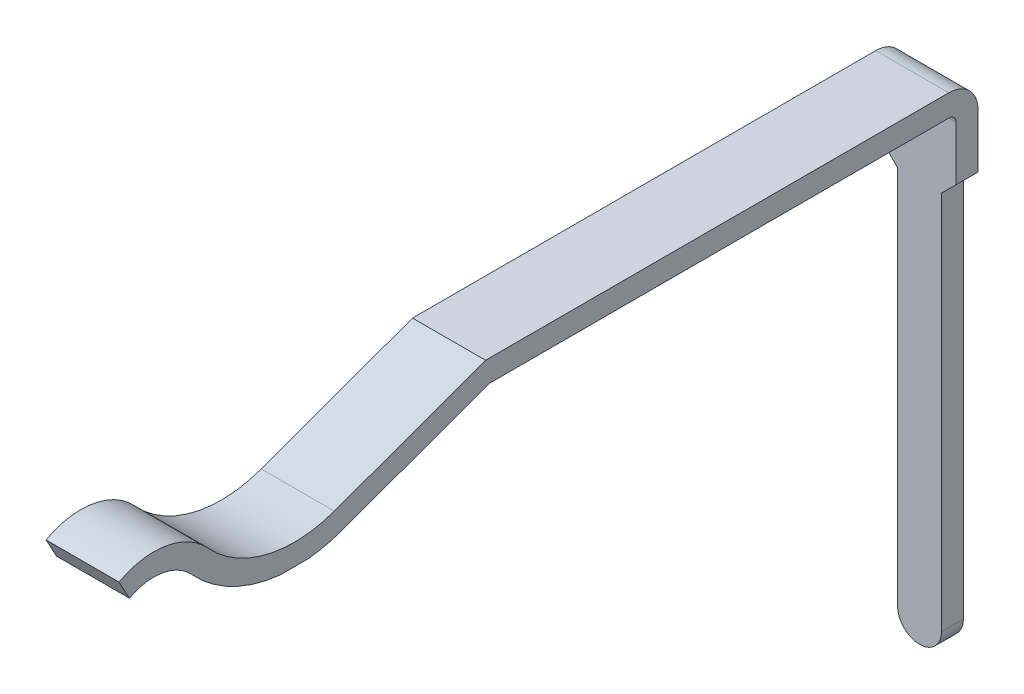
ISO-10303-21;
HEADER;
FILE_DESCRIPTION(('STEP AP214'),'2;1');
FILE_NAME('part.step','',(''),(''),'','','');
FILE_SCHEMA(('AUTOMOTIVE_DESIGN { 1 0 10303 214 1 1 1 1 }'));
ENDSEC;
DATA;
#1=APPLICATION_CONTEXT('core data for automotive mechanical design processes');
#2=APPLICATION_PROTOCOL_DEFINITION('international standard','automotive_design',2000,#1);
#3=PRODUCT_CONTEXT('',#1,'mechanical');
#4=PRODUCT('Part','Part','',(#3));
#5=PRODUCT_RELATED_PRODUCT_CATEGORY('part','',(#4));
#6=PRODUCT_DEFINITION_FORMATION('','',#4);
#7=PRODUCT_DEFINITION_CONTEXT('part definition',#1,'design');
#8=PRODUCT_DEFINITION('design','',#6,#7);
#9=PRODUCT_DEFINITION_SHAPE('','',#8);
#10=(LENGTH_UNIT() NAMED_UNIT(*) SI_UNIT(.MILLI.,.METRE.));
#11=(NAMED_UNIT(*) PLANE_ANGLE_UNIT() SI_UNIT($,.RADIAN.));
#12=(NAMED_UNIT(*) SI_UNIT($,.STERADIAN.) SOLID_ANGLE_UNIT());
#13=UNCERTAINTY_MEASURE_WITH_UNIT(LENGTH_MEASURE(1.E-05),#10,'distance_accuracy_value','');
#14=(GEOMETRIC_REPRESENTATION_CONTEXT(3) GLOBAL_UNCERTAINTY_ASSIGNED_CONTEXT((#13)) GLOBAL_UNIT_ASSIGNED_CONTEXT((#10,
#11,#12)) REPRESENTATION_CONTEXT('',''));
#15=CARTESIAN_POINT('',(0.,0.,0.));
#16=DIRECTION('',(0.,0.,1.));
#17=DIRECTION('',(1.,0.,0.));
#18=AXIS2_PLACEMENT_3D('',#15,#16,#17);
#19=CARTESIAN_POINT('',(0.5,-0.4,-12.46));
#20=DIRECTION('',(0.,0.,-1.));
#21=DIRECTION('',(0.,1.,0.));
#22=AXIS2_PLACEMENT_3D('',#19,#20,#21);
#23=PLANE('',#22);
#24=DIRECTION('',(0.,1.,0.));
#25=VECTOR('',#24,1.);
#26=CARTESIAN_POINT('',(0.3,-0.4,-12.46));
#27=LINE('',#26,#25);
#28=CARTESIAN_POINT('',(0.3,-6.54,-12.46));
#29=VERTEX_POINT('',#28);
#30=CARTESIAN_POINT('',(0.3,-1.34,-12.46));
#31=VERTEX_POINT('',#30);
#32=EDGE_CURVE('E221',#29,#31,#27,.T.);
#33=ORIENTED_EDGE('',*,*,#32,.T.);
#34=DIRECTION('',(0.707106781186551,0.707106781186544,0.));
#35=VECTOR('',#34,1.);
#36=CARTESIAN_POINT('',(0.870000000000001,-0.770000000000005,-12.46));
#37=LINE('',#36,#35);
#38=CARTESIAN_POINT('',(0.499999999999999,-1.14,-12.46));
#39=VERTEX_POINT('',#38);
#40=EDGE_CURVE('E216',#31,#39,#37,.T.);
#41=ORIENTED_EDGE('',*,*,#40,.T.);
#42=DIRECTION('',(0.,-1.,0.));
#43=VECTOR('',#42,1.);
#44=CARTESIAN_POINT('',(0.5,-0.4,-12.46));
#45=LINE('',#44,#43);
#46=CARTESIAN_POINT('',(0.5,-0.4,-12.46));
#47=VERTEX_POINT('',#46);
#48=EDGE_CURVE('E226',#47,#39,#45,.T.);
#49=ORIENTED_EDGE('',*,*,#48,.F.);
#50=DIRECTION('',(-1.,0.,0.));
#51=VECTOR('',#50,1.);
#52=CARTESIAN_POINT('',(0.5,-0.4,-12.46));
#53=LINE('',#52,#51);
#54=CARTESIAN_POINT('',(-0.5,-0.4,-12.46));
#55=VERTEX_POINT('',#54);
#56=EDGE_CURVE('E263',#47,#55,#53,.T.);
#57=ORIENTED_EDGE('',*,*,#56,.T.);
#58=DIRECTION('',(0.,-1.,0.));
#59=VECTOR('',#58,1.);
#60=CARTESIAN_POINT('',(-0.5,-0.4,-12.46));
#61=LINE('',#60,#59);
#62=CARTESIAN_POINT('',(-0.5,-1.14,-12.46));
#63=VERTEX_POINT('',#62);
#64=EDGE_CURVE('E225',#55,#63,#61,.T.);
#65=ORIENTED_EDGE('',*,*,#64,.T.);
#66=DIRECTION('',(0.707106781186544,-0.707106781186551,0.));
#67=VECTOR('',#66,1.);
#68=CARTESIAN_POINT('',(-0.370000000000004,-1.26999999999999,-12.46));
#69=LINE('',#68,#67);
#70=CARTESIAN_POINT('',(-0.3,-1.34,-12.46));
#71=VERTEX_POINT('',#70);
#72=EDGE_CURVE('E212',#63,#71,#69,.T.);
#73=ORIENTED_EDGE('',*,*,#72,.T.);
#74=DIRECTION('',(0.,-1.,0.));
#75=VECTOR('',#74,1.);
#76=CARTESIAN_POINT('',(-0.3,-0.4,-12.46));
#77=LINE('',#76,#75);
#78=CARTESIAN_POINT('',(-0.3,-6.54,-12.46));
#79=VERTEX_POINT('',#78);
#80=EDGE_CURVE('E219',#71,#79,#77,.T.);
#81=ORIENTED_EDGE('',*,*,#80,.T.);
#82=CARTESIAN_POINT('',(0.,-6.54,-12.46));
#83=DIRECTION('',(0.,0.,-1.));
#84=DIRECTION('',(0.,1.,0.));
#85=AXIS2_PLACEMENT_3D('',#82,#83,#84);
#86=CIRCLE('',#85,0.3);
#87=EDGE_CURVE('E175',#79,#29,#86,.F.);
#88=ORIENTED_EDGE('',*,*,#87,.T.);
#89=EDGE_LOOP('',(#33,#41,#49,#57,#65,#73,#81,#88));
#90=FACE_BOUND('',#89,.T.);
#91=ADVANCED_FACE('F34',(#90),#23,.F.);
#92=CARTESIAN_POINT('',(0.5,-0.4,-12.76));
#93=DIRECTION('',(0.,0.,-1.));
#94=DIRECTION('',(0.,1.,0.));
#95=AXIS2_PLACEMENT_3D('',#92,#93,#94);
#96=PLANE('',#95);
#97=DIRECTION('',(-0.707106781186551,-0.707106781186544,0.));
#98=VECTOR('',#97,1.);
#99=CARTESIAN_POINT('',(0.499999999999999,-1.14,-12.76));
#100=LINE('',#99,#98);
#101=CARTESIAN_POINT('',(0.499999999999999,-1.14,-12.76));
#102=VERTEX_POINT('',#101);
#103=CARTESIAN_POINT('',(0.3,-1.34,-12.76));
#104=VERTEX_POINT('',#103);
#105=EDGE_CURVE('E197',#102,#104,#100,.T.);
#106=ORIENTED_EDGE('',*,*,#105,.T.);
#107=DIRECTION('',(0.,-1.,0.));
#108=VECTOR('',#107,1.);
#109=CARTESIAN_POINT('',(0.3,-1.34,-12.76));
#110=LINE('',#109,#108);
#111=CARTESIAN_POINT('',(0.3,-6.54,-12.76));
#112=VERTEX_POINT('',#111);
#113=EDGE_CURVE('E179',#104,#112,#110,.T.);
#114=ORIENTED_EDGE('',*,*,#113,.T.);
#115=CARTESIAN_POINT('',(0.,-6.54,-12.76));
#116=DIRECTION('',(0.,0.,-1.));
#117=DIRECTION('',(1.,0.,0.));
#118=AXIS2_PLACEMENT_3D('',#115,#116,#117);
#119=CIRCLE('',#118,0.3);
#120=CARTESIAN_POINT('',(-0.3,-6.54,-12.76));
#121=VERTEX_POINT('',#120);
#122=EDGE_CURVE('E173',#112,#121,#119,.T.);
#123=ORIENTED_EDGE('',*,*,#122,.T.);
#124=DIRECTION('',(0.,1.,0.));
#125=VECTOR('',#124,1.);
#126=CARTESIAN_POINT('',(-0.3,-6.54,-12.76));
#127=LINE('',#126,#125);
#128=CARTESIAN_POINT('',(-0.3,-1.34,-12.76));
#129=VERTEX_POINT('',#128);
#130=EDGE_CURVE('E182',#121,#129,#127,.T.);
#131=ORIENTED_EDGE('',*,*,#130,.T.);
#132=DIRECTION('',(-0.707106781186544,0.707106781186551,0.));
#133=VECTOR('',#132,1.);
#134=CARTESIAN_POINT('',(-0.3,-1.34,-12.76));
#135=LINE('',#134,#133);
#136=CARTESIAN_POINT('',(-0.5,-1.14,-12.76));
#137=VERTEX_POINT('',#136);
#138=EDGE_CURVE('E188',#129,#137,#135,.T.);
#139=ORIENTED_EDGE('',*,*,#138,.T.);
#140=DIRECTION('',(0.,-1.,0.));
#141=VECTOR('',#140,1.);
#142=CARTESIAN_POINT('',(-0.5,-0.4,-12.76));
#143=LINE('',#142,#141);
#144=CARTESIAN_POINT('',(-0.5,-0.4,-12.76));
#145=VERTEX_POINT('',#144);
#146=EDGE_CURVE('E266',#145,#137,#143,.T.);
#147=ORIENTED_EDGE('',*,*,#146,.F.);
#148=DIRECTION('',(-1.,0.,0.));
#149=VECTOR('',#148,1.);
#150=CARTESIAN_POINT('',(0.5,-0.4,-12.76));
#151=LINE('',#150,#149);
#152=CARTESIAN_POINT('',(0.5,-0.4,-12.76));
#153=VERTEX_POINT('',#152);
#154=EDGE_CURVE('E324',#153,#145,#151,.T.);
#155=ORIENTED_EDGE('',*,*,#154,.F.);
#156=DIRECTION('',(0.,-1.,0.));
#157=VECTOR('',#156,1.);
#158=CARTESIAN_POINT('',(0.5,-0.4,-12.76));
#159=LINE('',#158,#157);
#160=EDGE_CURVE('E229',#153,#102,#159,.T.);
#161=ORIENTED_EDGE('',*,*,#160,.T.);
#162=EDGE_LOOP('',(#106,#114,#123,#131,#139,#147,#155,#161));
#163=FACE_BOUND('',#162,.T.);
#164=ADVANCED_FACE('F192',(#163),#96,.T.);
#165=CARTESIAN_POINT('',(0.5,-0.4,-12.36));
#166=DIRECTION('',(-1.,0.,0.));
#167=DIRECTION('',(0.,0.,1.));
#168=AXIS2_PLACEMENT_3D('',#165,#166,#167);
#169=CYLINDRICAL_SURFACE('',#168,0.4);
#170=CARTESIAN_POINT('',(-0.5,-0.4,-12.36));
#171=DIRECTION('',(-1.,0.,0.));
#172=DIRECTION('',(0.,0.,1.));
#173=AXIS2_PLACEMENT_3D('',#170,#171,#172);
#174=CIRCLE('',#173,0.4);
#175=CARTESIAN_POINT('',(-0.5,0.,-12.36));
#176=VERTEX_POINT('',#175);
#177=EDGE_CURVE('E269',#176,#145,#174,.T.);
#178=ORIENTED_EDGE('',*,*,#177,.F.);
#179=DIRECTION('',(-1.,0.,0.));
#180=VECTOR('',#179,1.);
#181=CARTESIAN_POINT('',(0.5,0.,-12.36));
#182=LINE('',#181,#180);
#183=CARTESIAN_POINT('',(0.5,0.,-12.36));
#184=VERTEX_POINT('',#183);
#185=EDGE_CURVE('E322',#184,#176,#182,.T.);
#186=ORIENTED_EDGE('',*,*,#185,.F.);
#187=CARTESIAN_POINT('',(0.5,-0.4,-12.36));
#188=DIRECTION('',(-1.,0.,0.));
#189=DIRECTION('',(0.,0.,1.));
#190=AXIS2_PLACEMENT_3D('',#187,#188,#189);
#191=CIRCLE('',#190,0.4);
#192=EDGE_CURVE('E233',#184,#153,#191,.T.);
#193=ORIENTED_EDGE('',*,*,#192,.T.);
#194=ORIENTED_EDGE('',*,*,#154,.T.);
#195=EDGE_LOOP('',(#178,#186,#193,#194));
#196=FACE_BOUND('',#195,.T.);
#197=ADVANCED_FACE('F378',(#196),#169,.T.);
#198=CARTESIAN_POINT('',(0.5,0.,-6.01747897566997));
#199=DIRECTION('',(0.,1.,0.));
#200=DIRECTION('',(0.,0.,1.));
#201=AXIS2_PLACEMENT_3D('',#198,#199,#200);
#202=PLANE('',#201);
#203=DIRECTION('',(0.,0.,-1.));
#204=VECTOR('',#203,1.);
#205=CARTESIAN_POINT('',(-0.5,0.,-6.01747897566997));
#206=LINE('',#205,#204);
#207=CARTESIAN_POINT('',(-0.5,0.,-6.01747897566997));
#208=VERTEX_POINT('',#207);
#209=EDGE_CURVE('E272',#208,#176,#206,.T.);
#210=ORIENTED_EDGE('',*,*,#209,.F.);
#211=DIRECTION('',(-1.,0.,0.));
#212=VECTOR('',#211,1.);
#213=CARTESIAN_POINT('',(0.5,0.,-6.01747897566997));
#214=LINE('',#213,#212);
#215=CARTESIAN_POINT('',(0.5,0.,-6.01747897566997));
#216=VERTEX_POINT('',#215);
#217=EDGE_CURVE('E320',#216,#208,#214,.T.);
#218=ORIENTED_EDGE('',*,*,#217,.F.);
#219=DIRECTION('',(0.,0.,-1.));
#220=VECTOR('',#219,1.);
#221=CARTESIAN_POINT('',(0.5,0.,-6.01747897566997));
#222=LINE('',#221,#220);
#223=EDGE_CURVE('E236',#216,#184,#222,.T.);
#224=ORIENTED_EDGE('',*,*,#223,.T.);
#225=ORIENTED_EDGE('',*,*,#185,.T.);
#226=EDGE_LOOP('',(#210,#218,#224,#225));
#227=FACE_BOUND('',#226,.T.);
#228=ADVANCED_FACE('F374',(#227),#202,.T.);
#229=CARTESIAN_POINT('',(0.5,0.,-6.01747897566997));
#230=DIRECTION('',(0.,0.939692620785908,0.342020143325669));
#231=DIRECTION('',(0.,-0.342020143325669,0.939692620785908));
#232=AXIS2_PLACEMENT_3D('',#229,#230,#231);
#233=PLANE('',#232);
#234=DIRECTION('',(0.,0.342020143325669,-0.939692620785908));
#235=VECTOR('',#234,1.);
#236=CARTESIAN_POINT('',(-0.5,0.,-6.01747897566997));
#237=LINE('',#236,#235);
#238=CARTESIAN_POINT('',(-0.5,-0.753508193257452,-3.94723222932107));
#239=VERTEX_POINT('',#238);
#240=EDGE_CURVE('E275',#239,#208,#237,.T.);
#241=ORIENTED_EDGE('',*,*,#240,.F.);
#242=DIRECTION('',(-1.,0.,0.));
#243=VECTOR('',#242,1.);
#244=CARTESIAN_POINT('',(0.5,-0.753508193257452,-3.94723222932107));
#245=LINE('',#244,#243);
#246=CARTESIAN_POINT('',(0.5,-0.753508193257452,-3.94723222932107));
#247=VERTEX_POINT('',#246);
#248=EDGE_CURVE('E318',#247,#239,#245,.T.);
#249=ORIENTED_EDGE('',*,*,#248,.F.);
#250=DIRECTION('',(0.,0.342020143325669,-0.939692620785908));
#251=VECTOR('',#250,1.);
#252=CARTESIAN_POINT('',(0.5,0.,-6.01747897566997));
#253=LINE('',#252,#251);
#254=EDGE_CURVE('E239',#247,#216,#253,.T.);
#255=ORIENTED_EDGE('',*,*,#254,.T.);
#256=ORIENTED_EDGE('',*,*,#217,.T.);
#257=EDGE_LOOP('',(#241,#249,#255,#256));
#258=FACE_BOUND('',#257,.T.);
#259=ADVANCED_FACE('F370',(#258),#233,.T.);
#260=CARTESIAN_POINT('',(0.5,0.750000000000001,-3.4));
#261=DIRECTION('',(-1.,0.,0.));
#262=DIRECTION('',(0.,0.,1.));
#263=AXIS2_PLACEMENT_3D('',#260,#261,#262);
#264=CYLINDRICAL_SURFACE('',#263,1.6);
#265=CARTESIAN_POINT('',(-0.5,0.750000000000001,-3.4));
#266=DIRECTION('',(1.,0.,0.));
#267=DIRECTION('',(0.,0.,1.));
#268=AXIS2_PLACEMENT_3D('',#265,#266,#267);
#269=CIRCLE('',#268,1.6);
#270=CARTESIAN_POINT('',(-0.5,-0.326923076923077,-2.21668402935204));
#271=VERTEX_POINT('',#270);
#272=EDGE_CURVE('E278',#271,#239,#269,.T.);
#273=ORIENTED_EDGE('',*,*,#272,.F.);
#274=DIRECTION('',(-1.,0.,0.));
#275=VECTOR('',#274,1.);
#276=CARTESIAN_POINT('',(0.5,-0.326923076923077,-2.21668402935204));
#277=LINE('',#276,#275);
#278=CARTESIAN_POINT('',(0.5,-0.326923076923077,-2.21668402935204));
#279=VERTEX_POINT('',#278);
#280=EDGE_CURVE('E316',#279,#271,#277,.T.);
#281=ORIENTED_EDGE('',*,*,#280,.F.);
#282=CARTESIAN_POINT('',(0.5,0.750000000000001,-3.4));
#283=DIRECTION('',(1.,0.,0.));
#284=DIRECTION('',(0.,0.,1.));
#285=AXIS2_PLACEMENT_3D('',#282,#283,#284);
#286=CIRCLE('',#285,1.6);
#287=EDGE_CURVE('E242',#279,#247,#286,.T.);
#288=ORIENTED_EDGE('',*,*,#287,.T.);
#289=ORIENTED_EDGE('',*,*,#248,.T.);
#290=EDGE_LOOP('',(#273,#281,#288,#289));
#291=FACE_BOUND('',#290,.T.);
#292=ADVANCED_FACE('F366',(#291),#264,.F.);
#293=CARTESIAN_POINT('',(0.5,-1.,-1.47711154769706));
#294=DIRECTION('',(-1.,0.,0.));
#295=DIRECTION('',(0.,0.,1.));
#296=AXIS2_PLACEMENT_3D('',#293,#294,#295);
#297=CYLINDRICAL_SURFACE('',#296,1.);
#298=CARTESIAN_POINT('',(-0.5,-1.,-1.47711154769706));
#299=DIRECTION('',(-1.,0.,0.));
#300=DIRECTION('',(0.,0.,-1.));
#301=AXIS2_PLACEMENT_3D('',#298,#299,#300);
#302=CIRCLE('',#301,1.);
#303=CARTESIAN_POINT('',(-0.5,-0.121157254650118,-1.));
#304=VERTEX_POINT('',#303);
#305=EDGE_CURVE('E281',#304,#271,#302,.T.);
#306=ORIENTED_EDGE('',*,*,#305,.F.);
#307=DIRECTION('',(-1.,0.,0.));
#308=VECTOR('',#307,1.);
#309=CARTESIAN_POINT('',(0.5,-0.121157254650118,-1.));
#310=LINE('',#309,#308);
#311=CARTESIAN_POINT('',(0.5,-0.121157254650118,-1.));
#312=VERTEX_POINT('',#311);
#313=EDGE_CURVE('E314',#312,#304,#310,.T.);
#314=ORIENTED_EDGE('',*,*,#313,.F.);
#315=CARTESIAN_POINT('',(0.5,-1.,-1.47711154769706));
#316=DIRECTION('',(-1.,0.,0.));
#317=DIRECTION('',(0.,0.,-1.));
#318=AXIS2_PLACEMENT_3D('',#315,#316,#317);
#319=CIRCLE('',#318,1.);
#320=EDGE_CURVE('E245',#312,#279,#319,.T.);
#321=ORIENTED_EDGE('',*,*,#320,.T.);
#322=ORIENTED_EDGE('',*,*,#280,.T.);
#323=EDGE_LOOP('',(#306,#314,#321,#322));
#324=FACE_BOUND('',#323,.T.);
#325=ADVANCED_FACE('F362',(#324),#297,.T.);
#326=CARTESIAN_POINT('',(0.5,-0.384810078255083,-1.14313346430912));
#327=DIRECTION('',(0.,-0.477111547697059,0.878842745349882));
#328=DIRECTION('',(0.,-0.878842745349882,-0.477111547697059));
#329=AXIS2_PLACEMENT_3D('',#326,#327,#328);
#330=PLANE('',#329);
#331=DIRECTION('',(0.,0.878842745349882,0.477111547697059));
#332=VECTOR('',#331,1.);
#333=CARTESIAN_POINT('',(-0.5,-0.384810078255083,-1.14313346430912));
#334=LINE('',#333,#332);
#335=CARTESIAN_POINT('',(-0.5,-0.384810078255083,-1.14313346430912));
#336=VERTEX_POINT('',#335);
#337=EDGE_CURVE('E284',#336,#304,#334,.T.);
#338=ORIENTED_EDGE('',*,*,#337,.F.);
#339=DIRECTION('',(-1.,0.,0.));
#340=VECTOR('',#339,1.);
#341=CARTESIAN_POINT('',(0.5,-0.384810078255083,-1.14313346430912));
#342=LINE('',#341,#340);
#343=CARTESIAN_POINT('',(0.5,-0.384810078255083,-1.14313346430912));
#344=VERTEX_POINT('',#343);
#345=EDGE_CURVE('E312',#344,#336,#342,.T.);
#346=ORIENTED_EDGE('',*,*,#345,.F.);
#347=DIRECTION('',(0.,0.878842745349882,0.477111547697059));
#348=VECTOR('',#347,1.);
#349=CARTESIAN_POINT('',(0.5,-0.384810078255083,-1.14313346430912));
#350=LINE('',#349,#348);
#351=EDGE_CURVE('E248',#344,#312,#350,.T.);
#352=ORIENTED_EDGE('',*,*,#351,.T.);
#353=ORIENTED_EDGE('',*,*,#313,.T.);
#354=EDGE_LOOP('',(#338,#346,#352,#353));
#355=FACE_BOUND('',#354,.T.);
#356=ADVANCED_FACE('F359',(#355),#330,.T.);
#357=CARTESIAN_POINT('',(0.5,-1.,-1.47711154769706));
#358=DIRECTION('',(-1.,0.,0.));
#359=DIRECTION('',(0.,0.,1.));
#360=AXIS2_PLACEMENT_3D('',#357,#358,#359);
#361=CYLINDRICAL_SURFACE('',#360,0.7);
#362=CARTESIAN_POINT('',(-0.5,-1.,-1.47711154769706));
#363=DIRECTION('',(1.,0.,0.));
#364=DIRECTION('',(0.,0.,-1.));
#365=AXIS2_PLACEMENT_3D('',#362,#363,#364);
#366=CIRCLE('',#365,0.7);
#367=CARTESIAN_POINT('',(-0.5,-0.528846153846154,-1.99481228485554));
#368=VERTEX_POINT('',#367);
#369=EDGE_CURVE('E287',#336,#368,#366,.F.);
#370=ORIENTED_EDGE('',*,*,#369,.T.);
#371=DIRECTION('',(-1.,0.,0.));
#372=VECTOR('',#371,1.);
#373=CARTESIAN_POINT('',(0.5,-0.528846153846154,-1.99481228485554));
#374=LINE('',#373,#372);
#375=CARTESIAN_POINT('',(0.5,-0.528846153846154,-1.99481228485554));
#376=VERTEX_POINT('',#375);
#377=EDGE_CURVE('E309',#376,#368,#374,.T.);
#378=ORIENTED_EDGE('',*,*,#377,.F.);
#379=CARTESIAN_POINT('',(0.5,-1.,-1.47711154769706));
#380=DIRECTION('',(1.,0.,0.));
#381=DIRECTION('',(0.,0.,-1.));
#382=AXIS2_PLACEMENT_3D('',#379,#380,#381);
#383=CIRCLE('',#382,0.7);
#384=EDGE_CURVE('E251',#344,#376,#383,.F.);
#385=ORIENTED_EDGE('',*,*,#384,.F.);
#386=ORIENTED_EDGE('',*,*,#345,.T.);
#387=EDGE_LOOP('',(#370,#378,#385,#386));
#388=FACE_BOUND('',#387,.T.);
#389=ADVANCED_FACE('F355',(#388),#361,.F.);
#390=CARTESIAN_POINT('',(0.5,0.750000000000001,-3.4));
#391=DIRECTION('',(-1.,0.,0.));
#392=DIRECTION('',(0.,0.,1.));
#393=AXIS2_PLACEMENT_3D('',#390,#391,#392);
#394=CYLINDRICAL_SURFACE('',#393,1.9);
#395=CARTESIAN_POINT('',(0.5,0.750000000000001,-3.4));
#396=DIRECTION('',(1.,0.,0.));
#397=DIRECTION('',(0.,0.,-1.));
#398=AXIS2_PLACEMENT_3D('',#395,#396,#397);
#399=CIRCLE('',#398,1.9);
#400=CARTESIAN_POINT('',(0.5,-1.14,-3.5946792233393));
#401=VERTEX_POINT('',#400);
#402=CARTESIAN_POINT('',(0.5,-1.03541597949322,-4.04983827231877));
#403=VERTEX_POINT('',#402);
#404=EDGE_CURVE('E253',#401,#403,#399,.T.);
#405=ORIENTED_EDGE('',*,*,#404,.F.);
#406=CARTESIAN_POINT('',(2.39000000000002,0.750000000000001,-3.4));
#407=DIRECTION('',(-0.707106781186544,0.707106781186551,0.));
#408=DIRECTION('',(-0.707106781186551,-0.707106781186544,0.));
#409=AXIS2_PLACEMENT_3D('',#406,#407,#408);
#410=ELLIPSE('',#409,2.6870057685089,1.9);
#411=CARTESIAN_POINT('',(0.499999999999999,-1.14,-3.2053207766607));
#412=VERTEX_POINT('',#411);
#413=EDGE_CURVE('E47',#401,#412,#410,.T.);
#414=ORIENTED_EDGE('',*,*,#413,.T.);
#415=EDGE_CURVE('E254',#376,#412,#399,.T.);
#416=ORIENTED_EDGE('',*,*,#415,.F.);
#417=ORIENTED_EDGE('',*,*,#377,.T.);
#418=CARTESIAN_POINT('',(-0.5,0.750000000000001,-3.4));
#419=DIRECTION('',(1.,0.,0.));
#420=DIRECTION('',(0.,0.,-1.));
#421=AXIS2_PLACEMENT_3D('',#418,#419,#420);
#422=CIRCLE('',#421,1.9);
#423=CARTESIAN_POINT('',(-0.5,-1.14,-3.20532077666066));
#424=VERTEX_POINT('',#423);
#425=EDGE_CURVE('E290',#368,#424,#422,.T.);
#426=ORIENTED_EDGE('',*,*,#425,.T.);
#427=CARTESIAN_POINT('',(-2.38999999999998,0.750000000000001,-3.4));
#428=DIRECTION('',(0.707106781186551,0.707106781186544,0.));
#429=DIRECTION('',(-0.707106781186544,0.707106781186551,0.));
#430=AXIS2_PLACEMENT_3D('',#427,#428,#429);
#431=ELLIPSE('',#430,2.68700576850887,1.9);
#432=CARTESIAN_POINT('',(-0.5,-1.14,-3.59467922333934));
#433=VERTEX_POINT('',#432);
#434=EDGE_CURVE('E53',#424,#433,#431,.T.);
#435=ORIENTED_EDGE('',*,*,#434,.T.);
#436=CARTESIAN_POINT('',(-0.5,-1.03541597949322,-4.04983827231877));
#437=VERTEX_POINT('',#436);
#438=EDGE_CURVE('E289',#433,#437,#422,.T.);
#439=ORIENTED_EDGE('',*,*,#438,.T.);
#440=DIRECTION('',(-1.,0.,0.));
#441=VECTOR('',#440,1.);
#442=CARTESIAN_POINT('',(0.5,-1.03541597949322,-4.04983827231877));
#443=LINE('',#442,#441);
#444=EDGE_CURVE('E306',#403,#437,#443,.T.);
#445=ORIENTED_EDGE('',*,*,#444,.F.);
#446=EDGE_LOOP('',(#405,#414,#416,#417,#426,#435,#439,#445));
#447=FACE_BOUND('',#446,.T.);
#448=ADVANCED_FACE('F331',(#447),#394,.T.);
#449=CARTESIAN_POINT('',(0.5,-0.281907786235772,-6.12008501866767));
#450=DIRECTION('',(0.,0.939692620785908,0.342020143325669));
#451=DIRECTION('',(0.,-0.342020143325669,0.939692620785908));
#452=AXIS2_PLACEMENT_3D('',#449,#450,#451);
#453=PLANE('',#452);
#454=DIRECTION('',(0.,0.342020143325669,-0.939692620785908));
#455=VECTOR('',#454,1.);
#456=CARTESIAN_POINT('',(-0.5,-0.281907786235772,-6.12008501866767));
#457=LINE('',#456,#455);
#458=CARTESIAN_POINT('',(-0.5,-0.3,-6.07037706988251));
#459=VERTEX_POINT('',#458);
#460=EDGE_CURVE('E293',#437,#459,#457,.T.);
#461=ORIENTED_EDGE('',*,*,#460,.T.);
#462=DIRECTION('',(-1.,0.,0.));
#463=VECTOR('',#462,1.);
#464=CARTESIAN_POINT('',(0.5,-0.3,-6.07037706988251));
#465=LINE('',#464,#463);
#466=CARTESIAN_POINT('',(0.5,-0.3,-6.07037706988251));
#467=VERTEX_POINT('',#466);
#468=EDGE_CURVE('E303',#467,#459,#465,.T.);
#469=ORIENTED_EDGE('',*,*,#468,.F.);
#470=DIRECTION('',(0.,0.342020143325669,-0.939692620785908));
#471=VECTOR('',#470,1.);
#472=CARTESIAN_POINT('',(0.5,-0.281907786235772,-6.12008501866767));
#473=LINE('',#472,#471);
#474=EDGE_CURVE('E257',#403,#467,#473,.T.);
#475=ORIENTED_EDGE('',*,*,#474,.F.);
#476=ORIENTED_EDGE('',*,*,#444,.T.);
#477=EDGE_LOOP('',(#461,#469,#475,#476));
#478=FACE_BOUND('',#477,.T.);
#479=ADVANCED_FACE('F339',(#478),#453,.F.);
#480=CARTESIAN_POINT('',(0.5,-0.3,-6.01747897566997));
#481=DIRECTION('',(0.,1.,0.));
#482=DIRECTION('',(0.,0.,1.));
#483=AXIS2_PLACEMENT_3D('',#480,#481,#482);
#484=PLANE('',#483);
#485=DIRECTION('',(0.,0.,-1.));
#486=VECTOR('',#485,1.);
#487=CARTESIAN_POINT('',(-0.5,-0.3,-6.01747897566997));
#488=LINE('',#487,#486);
#489=CARTESIAN_POINT('',(-0.5,-0.3,-12.36));
#490=VERTEX_POINT('',#489);
#491=EDGE_CURVE('E295',#459,#490,#488,.T.);
#492=ORIENTED_EDGE('',*,*,#491,.T.);
#493=DIRECTION('',(-1.,0.,0.));
#494=VECTOR('',#493,1.);
#495=CARTESIAN_POINT('',(0.5,-0.3,-12.36));
#496=LINE('',#495,#494);
#497=CARTESIAN_POINT('',(0.5,-0.3,-12.36));
#498=VERTEX_POINT('',#497);
#499=EDGE_CURVE('E300',#498,#490,#496,.T.);
#500=ORIENTED_EDGE('',*,*,#499,.F.);
#501=DIRECTION('',(0.,0.,-1.));
#502=VECTOR('',#501,1.);
#503=CARTESIAN_POINT('',(0.5,-0.3,-6.01747897566997));
#504=LINE('',#503,#502);
#505=EDGE_CURVE('E259',#467,#498,#504,.T.);
#506=ORIENTED_EDGE('',*,*,#505,.F.);
#507=ORIENTED_EDGE('',*,*,#468,.T.);
#508=EDGE_LOOP('',(#492,#500,#506,#507));
#509=FACE_BOUND('',#508,.T.);
#510=ADVANCED_FACE('F343',(#509),#484,.F.);
#511=CARTESIAN_POINT('',(0.5,-0.4,-12.36));
#512=DIRECTION('',(-1.,0.,0.));
#513=DIRECTION('',(0.,0.,1.));
#514=AXIS2_PLACEMENT_3D('',#511,#512,#513);
#515=CYLINDRICAL_SURFACE('',#514,0.0999999999999997);
#516=CARTESIAN_POINT('',(-0.5,-0.4,-12.36));
#517=DIRECTION('',(1.,0.,0.));
#518=DIRECTION('',(0.,0.,-1.));
#519=AXIS2_PLACEMENT_3D('',#516,#517,#518);
#520=CIRCLE('',#519,0.0999999999999997);
#521=EDGE_CURVE('E230',#490,#55,#520,.F.);
#522=ORIENTED_EDGE('',*,*,#521,.T.);
#523=ORIENTED_EDGE('',*,*,#56,.F.);
#524=CARTESIAN_POINT('',(0.5,-0.4,-12.36));
#525=DIRECTION('',(1.,0.,0.));
#526=DIRECTION('',(0.,0.,-1.));
#527=AXIS2_PLACEMENT_3D('',#524,#525,#526);
#528=CIRCLE('',#527,0.0999999999999997);
#529=EDGE_CURVE('E261',#498,#47,#528,.F.);
#530=ORIENTED_EDGE('',*,*,#529,.F.);
#531=ORIENTED_EDGE('',*,*,#499,.T.);
#532=EDGE_LOOP('',(#522,#523,#530,#531));
#533=FACE_BOUND('',#532,.T.);
#534=ADVANCED_FACE('F387',(#533),#515,.F.);
#535=CARTESIAN_POINT('',(0.5,-0.4,-12.36));
#536=DIRECTION('',(-1.,0.,0.));
#537=DIRECTION('',(0.,0.,1.));
#538=AXIS2_PLACEMENT_3D('',#535,#536,#537);
#539=PLANE('',#538);
#540=ORIENTED_EDGE('',*,*,#415,.T.);
#541=DIRECTION('',(0.,0.,-1.));
#542=VECTOR('',#541,1.);
#543=CARTESIAN_POINT('',(0.5,-1.14,-12.36));
#544=LINE('',#543,#542);
#545=EDGE_CURVE('E11',#412,#401,#544,.T.);
#546=ORIENTED_EDGE('',*,*,#545,.T.);
#547=ORIENTED_EDGE('',*,*,#404,.T.);
#548=ORIENTED_EDGE('',*,*,#474,.T.);
#549=ORIENTED_EDGE('',*,*,#505,.T.);
#550=ORIENTED_EDGE('',*,*,#529,.T.);
#551=ORIENTED_EDGE('',*,*,#48,.T.);
#552=DIRECTION('',(0.,0.,1.));
#553=VECTOR('',#552,1.);
#554=CARTESIAN_POINT('',(0.499999999999999,-1.14,-12.76));
#555=LINE('',#554,#553);
#556=EDGE_CURVE('E205',#102,#39,#555,.T.);
#557=ORIENTED_EDGE('',*,*,#556,.F.);
#558=ORIENTED_EDGE('',*,*,#160,.F.);
#559=ORIENTED_EDGE('',*,*,#192,.F.);
#560=ORIENTED_EDGE('',*,*,#223,.F.);
#561=ORIENTED_EDGE('',*,*,#254,.F.);
#562=ORIENTED_EDGE('',*,*,#287,.F.);
#563=ORIENTED_EDGE('',*,*,#320,.F.);
#564=ORIENTED_EDGE('',*,*,#351,.F.);
#565=ORIENTED_EDGE('',*,*,#384,.T.);
#566=EDGE_LOOP('',(#540,#546,#547,#548,#549,#550,#551,#557,#558,#559,#560,#561,#562,#563,#564,#565));
#567=FACE_BOUND('',#566,.T.);
#568=ADVANCED_FACE('F347',(#567),#539,.F.);
#569=CARTESIAN_POINT('',(-0.5,-0.4,-12.36));
#570=DIRECTION('',(-1.,0.,0.));
#571=DIRECTION('',(0.,0.,1.));
#572=AXIS2_PLACEMENT_3D('',#569,#570,#571);
#573=PLANE('',#572);
#574=DIRECTION('',(0.,0.,-1.));
#575=VECTOR('',#574,1.);
#576=CARTESIAN_POINT('',(-0.5,-1.14,-12.36));
#577=LINE('',#576,#575);
#578=EDGE_CURVE('E41',#424,#433,#577,.T.);
#579=ORIENTED_EDGE('',*,*,#578,.F.);
#580=ORIENTED_EDGE('',*,*,#425,.F.);
#581=ORIENTED_EDGE('',*,*,#369,.F.);
#582=ORIENTED_EDGE('',*,*,#337,.T.);
#583=ORIENTED_EDGE('',*,*,#305,.T.);
#584=ORIENTED_EDGE('',*,*,#272,.T.);
#585=ORIENTED_EDGE('',*,*,#240,.T.);
#586=ORIENTED_EDGE('',*,*,#209,.T.);
#587=ORIENTED_EDGE('',*,*,#177,.T.);
#588=ORIENTED_EDGE('',*,*,#146,.T.);
#589=DIRECTION('',(0.,0.,1.));
#590=VECTOR('',#589,1.);
#591=CARTESIAN_POINT('',(-0.5,-1.14,-12.76));
#592=LINE('',#591,#590);
#593=EDGE_CURVE('E207',#137,#63,#592,.T.);
#594=ORIENTED_EDGE('',*,*,#593,.T.);
#595=ORIENTED_EDGE('',*,*,#64,.F.);
#596=ORIENTED_EDGE('',*,*,#521,.F.);
#597=ORIENTED_EDGE('',*,*,#491,.F.);
#598=ORIENTED_EDGE('',*,*,#460,.F.);
#599=ORIENTED_EDGE('',*,*,#438,.F.);
#600=EDGE_LOOP('',(#579,#580,#581,#582,#583,#584,#585,#586,#587,#588,#594,#595,#596,#597,#598,#599));
#601=FACE_BOUND('',#600,.T.);
#602=ADVANCED_FACE('F334',(#601),#573,.T.);
#603=CARTESIAN_POINT('',(0.499999999999999,-1.14,-12.76));
#604=DIRECTION('',(-0.707106781186544,0.707106781186551,0.));
#605=DIRECTION('',(-0.707106781186551,-0.707106781186544,0.));
#606=AXIS2_PLACEMENT_3D('',#603,#604,#605);
#607=PLANE('',#606);
#608=DIRECTION('',(0.,0.,1.));
#609=VECTOR('',#608,1.);
#610=CARTESIAN_POINT('',(0.3,-1.34,-12.76));
#611=LINE('',#610,#609);
#612=EDGE_CURVE('E202',#104,#31,#611,.T.);
#613=ORIENTED_EDGE('',*,*,#612,.F.);
#614=ORIENTED_EDGE('',*,*,#105,.F.);
#615=ORIENTED_EDGE('',*,*,#556,.T.);
#616=ORIENTED_EDGE('',*,*,#40,.F.);
#617=EDGE_LOOP('',(#613,#614,#615,#616));
#618=FACE_BOUND('',#617,.T.);
#619=ADVANCED_FACE('F463',(#618),#607,.F.);
#620=CARTESIAN_POINT('',(0.3,-1.34,-12.76));
#621=DIRECTION('',(-1.,0.,0.));
#622=DIRECTION('',(0.,-1.,0.));
#623=AXIS2_PLACEMENT_3D('',#620,#621,#622);
#624=PLANE('',#623);
#625=DIRECTION('',(0.,0.,1.));
#626=VECTOR('',#625,1.);
#627=CARTESIAN_POINT('',(0.3,-6.54,-12.76));
#628=LINE('',#627,#626);
#629=EDGE_CURVE('E200',#112,#29,#628,.T.);
#630=ORIENTED_EDGE('',*,*,#629,.F.);
#631=ORIENTED_EDGE('',*,*,#113,.F.);
#632=ORIENTED_EDGE('',*,*,#612,.T.);
#633=ORIENTED_EDGE('',*,*,#32,.F.);
#634=EDGE_LOOP('',(#630,#631,#632,#633));
#635=FACE_BOUND('',#634,.T.);
#636=ADVANCED_FACE('F471',(#635),#624,.F.);
#637=CARTESIAN_POINT('',(-0.3,-1.34,-12.76));
#638=DIRECTION('',(0.707106781186551,0.707106781186544,0.));
#639=DIRECTION('',(-0.707106781186544,0.707106781186551,0.));
#640=AXIS2_PLACEMENT_3D('',#637,#638,#639);
#641=PLANE('',#640);
#642=ORIENTED_EDGE('',*,*,#593,.F.);
#643=ORIENTED_EDGE('',*,*,#138,.F.);
#644=DIRECTION('',(0.,0.,1.));
#645=VECTOR('',#644,1.);
#646=CARTESIAN_POINT('',(-0.3,-1.34,-12.76));
#647=LINE('',#646,#645);
#648=EDGE_CURVE('E178',#129,#71,#647,.T.);
#649=ORIENTED_EDGE('',*,*,#648,.T.);
#650=ORIENTED_EDGE('',*,*,#72,.F.);
#651=EDGE_LOOP('',(#642,#643,#649,#650));
#652=FACE_BOUND('',#651,.T.);
#653=ADVANCED_FACE('F382',(#652),#641,.F.);
#654=CARTESIAN_POINT('',(-0.3,-6.54,-12.76));
#655=DIRECTION('',(1.,0.,0.));
#656=DIRECTION('',(0.,1.,0.));
#657=AXIS2_PLACEMENT_3D('',#654,#655,#656);
#658=PLANE('',#657);
#659=ORIENTED_EDGE('',*,*,#648,.F.);
#660=ORIENTED_EDGE('',*,*,#130,.F.);
#661=DIRECTION('',(0.,0.,1.));
#662=VECTOR('',#661,1.);
#663=CARTESIAN_POINT('',(-0.3,-6.54,-12.76));
#664=LINE('',#663,#662);
#665=EDGE_CURVE('E168',#121,#79,#664,.T.);
#666=ORIENTED_EDGE('',*,*,#665,.T.);
#667=ORIENTED_EDGE('',*,*,#80,.F.);
#668=EDGE_LOOP('',(#659,#660,#666,#667));
#669=FACE_BOUND('',#668,.T.);
#670=ADVANCED_FACE('F183',(#669),#658,.F.);
#671=CARTESIAN_POINT('',(0.,-6.54,-12.76));
#672=DIRECTION('',(0.,0.,1.));
#673=DIRECTION('',(1.,0.,0.));
#674=AXIS2_PLACEMENT_3D('',#671,#672,#673);
#675=CYLINDRICAL_SURFACE('',#674,0.3);
#676=ORIENTED_EDGE('',*,*,#665,.F.);
#677=ORIENTED_EDGE('',*,*,#122,.F.);
#678=ORIENTED_EDGE('',*,*,#629,.T.);
#679=ORIENTED_EDGE('',*,*,#87,.F.);
#680=EDGE_LOOP('',(#676,#677,#678,#679));
#681=FACE_BOUND('',#680,.T.);
#682=ADVANCED_FACE('F170',(#681),#675,.T.);
#683=ORIENTED_EDGE('',*,*,#578,.T.);
#684=ORIENTED_EDGE('',*,*,#434,.F.);
#685=EDGE_LOOP('',(#683,#684));
#686=FACE_BOUND('',#685,.T.);
#687=ADVANCED_FACE('F325',(#686),#641,.F.);
#688=ORIENTED_EDGE('',*,*,#545,.F.);
#689=ORIENTED_EDGE('',*,*,#413,.F.);
#690=EDGE_LOOP('',(#688,#689));
#691=FACE_BOUND('',#690,.T.);
#692=ADVANCED_FACE('F474',(#691),#607,.F.);
#693=CLOSED_SHELL('',(#91,#164,#197,#228,#259,#292,#325,#356,#389,#448,#479,#510,#534,#568,#602,
#619,#636,#653,#670,#682,#687,#692));
#694=MANIFOLD_SOLID_BREP('B2',#693);
#695=ADVANCED_BREP_SHAPE_REPRESENTATION('',(#18,#694),#14);
#696=SHAPE_DEFINITION_REPRESENTATION(#9,#695);
ENDSEC;
END-ISO-10303-21;
